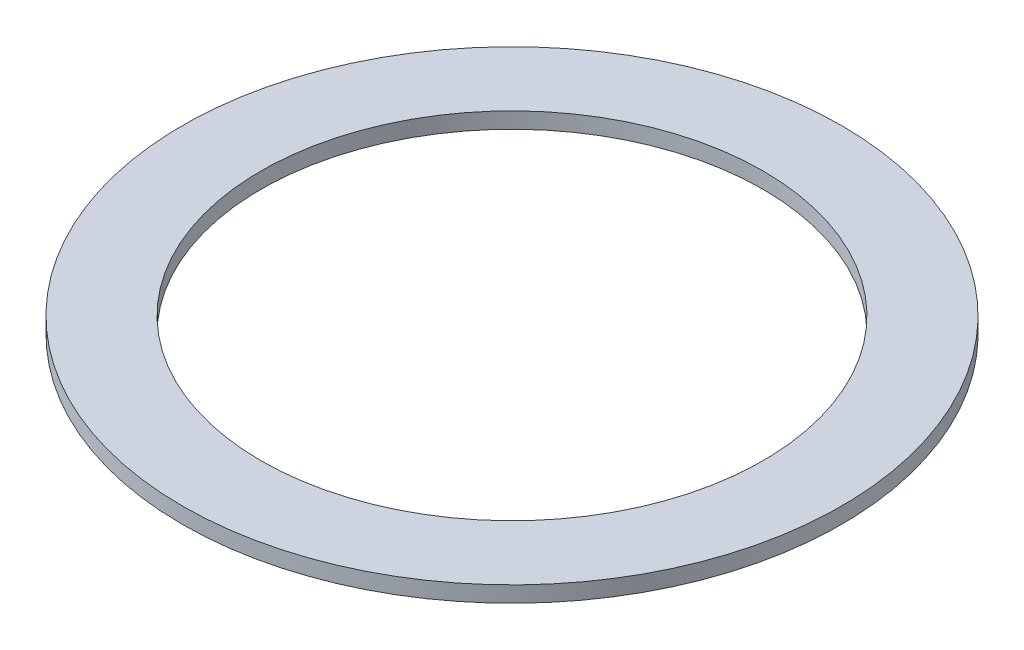
ISO-10303-21;
HEADER;
FILE_DESCRIPTION(('STEP AP214'),'2;1');
FILE_NAME('part.step','',(''),(''),'','','');
FILE_SCHEMA(('AUTOMOTIVE_DESIGN { 1 0 10303 214 1 1 1 1 }'));
ENDSEC;
DATA;
#1=APPLICATION_CONTEXT('core data for automotive mechanical design processes');
#2=APPLICATION_PROTOCOL_DEFINITION('international standard','automotive_design',2000,#1);
#3=PRODUCT_CONTEXT('',#1,'mechanical');
#4=PRODUCT('Part','Part','',(#3));
#5=PRODUCT_RELATED_PRODUCT_CATEGORY('part','',(#4));
#6=PRODUCT_DEFINITION_FORMATION('','',#4);
#7=PRODUCT_DEFINITION_CONTEXT('part definition',#1,'design');
#8=PRODUCT_DEFINITION('design','',#6,#7);
#9=PRODUCT_DEFINITION_SHAPE('','',#8);
#10=(LENGTH_UNIT() NAMED_UNIT(*) SI_UNIT(.MILLI.,.METRE.));
#11=(NAMED_UNIT(*) PLANE_ANGLE_UNIT() SI_UNIT($,.RADIAN.));
#12=(NAMED_UNIT(*) SI_UNIT($,.STERADIAN.) SOLID_ANGLE_UNIT());
#13=UNCERTAINTY_MEASURE_WITH_UNIT(LENGTH_MEASURE(1.E-05),#10,'distance_accuracy_value','');
#14=(GEOMETRIC_REPRESENTATION_CONTEXT(3) GLOBAL_UNCERTAINTY_ASSIGNED_CONTEXT((#13)) GLOBAL_UNIT_ASSIGNED_CONTEXT((#10,
#11,#12)) REPRESENTATION_CONTEXT('',''));
#15=CARTESIAN_POINT('',(0.,0.,0.));
#16=DIRECTION('',(0.,0.,1.));
#17=DIRECTION('',(1.,0.,0.));
#18=AXIS2_PLACEMENT_3D('',#15,#16,#17);
#19=CARTESIAN_POINT('',(0.,0.381,0.));
#20=DIRECTION('',(0.,1.,0.));
#21=DIRECTION('',(0.,0.,1.));
#22=AXIS2_PLACEMENT_3D('',#19,#20,#21);
#23=PLANE('',#22);
#24=CARTESIAN_POINT('',(0.,0.381,0.));
#25=DIRECTION('',(0.,1.,0.));
#26=DIRECTION('',(0.,0.,1.));
#27=AXIS2_PLACEMENT_3D('',#24,#25,#26);
#28=CIRCLE('',#27,7.8867);
#29=CARTESIAN_POINT('',(0.,0.381,7.8867));
#30=VERTEX_POINT('',#29);
#31=EDGE_CURVE('E10',#30,#30,#28,.T.);
#32=ORIENTED_EDGE('',*,*,#31,.T.);
#33=EDGE_LOOP('',(#32));
#34=FACE_BOUND('',#33,.T.);
#35=CARTESIAN_POINT('',(0.,0.381,0.));
#36=DIRECTION('',(0.,1.,0.));
#37=DIRECTION('',(0.,0.,1.));
#38=AXIS2_PLACEMENT_3D('',#35,#36,#37);
#39=CIRCLE('',#38,6.0071);
#40=CARTESIAN_POINT('',(0.,0.381,6.0071));
#41=VERTEX_POINT('',#40);
#42=EDGE_CURVE('E42',#41,#41,#39,.T.);
#43=ORIENTED_EDGE('',*,*,#42,.F.);
#44=EDGE_LOOP('',(#43));
#45=FACE_BOUND('',#44,.T.);
#46=ADVANCED_FACE('F31',(#34,#45),#23,.T.);
#47=CARTESIAN_POINT('',(0.,0.,0.));
#48=DIRECTION('',(0.,1.,0.));
#49=DIRECTION('',(0.,0.,1.));
#50=AXIS2_PLACEMENT_3D('',#47,#48,#49);
#51=PLANE('',#50);
#52=CARTESIAN_POINT('',(0.,0.,0.));
#53=DIRECTION('',(0.,1.,0.));
#54=DIRECTION('',(0.,0.,1.));
#55=AXIS2_PLACEMENT_3D('',#52,#53,#54);
#56=CIRCLE('',#55,7.8867);
#57=CARTESIAN_POINT('',(0.,0.,7.8867));
#58=VERTEX_POINT('',#57);
#59=EDGE_CURVE('E35',#58,#58,#56,.T.);
#60=ORIENTED_EDGE('',*,*,#59,.F.);
#61=EDGE_LOOP('',(#60));
#62=FACE_BOUND('',#61,.T.);
#63=CARTESIAN_POINT('',(0.,0.,0.));
#64=DIRECTION('',(0.,1.,0.));
#65=DIRECTION('',(0.,0.,1.));
#66=AXIS2_PLACEMENT_3D('',#63,#64,#65);
#67=CIRCLE('',#66,6.0071);
#68=CARTESIAN_POINT('',(0.,0.,6.0071));
#69=VERTEX_POINT('',#68);
#70=EDGE_CURVE('E44',#69,#69,#67,.T.);
#71=ORIENTED_EDGE('',*,*,#70,.T.);
#72=EDGE_LOOP('',(#71));
#73=FACE_BOUND('',#72,.T.);
#74=ADVANCED_FACE('F54',(#62,#73),#51,.F.);
#75=CARTESIAN_POINT('',(0.,0.381,0.));
#76=DIRECTION('',(0.,-1.,0.));
#77=DIRECTION('',(0.,0.,-1.));
#78=AXIS2_PLACEMENT_3D('',#75,#76,#77);
#79=CYLINDRICAL_SURFACE('',#78,7.8867);
#80=ORIENTED_EDGE('',*,*,#31,.F.);
#81=EDGE_LOOP('',(#80));
#82=FACE_BOUND('',#81,.T.);
#83=ORIENTED_EDGE('',*,*,#59,.T.);
#84=EDGE_LOOP('',(#83));
#85=FACE_BOUND('',#84,.T.);
#86=ADVANCED_FACE('F33',(#82,#85),#79,.T.);
#87=CARTESIAN_POINT('',(0.,0.381,0.));
#88=DIRECTION('',(0.,-1.,0.));
#89=DIRECTION('',(0.,0.,-1.));
#90=AXIS2_PLACEMENT_3D('',#87,#88,#89);
#91=CYLINDRICAL_SURFACE('',#90,6.0071);
#92=ORIENTED_EDGE('',*,*,#42,.T.);
#93=EDGE_LOOP('',(#92));
#94=FACE_BOUND('',#93,.T.);
#95=ORIENTED_EDGE('',*,*,#70,.F.);
#96=EDGE_LOOP('',(#95));
#97=FACE_BOUND('',#96,.T.);
#98=ADVANCED_FACE('F50',(#94,#97),#91,.F.);
#99=CLOSED_SHELL('',(#46,#74,#86,#98));
#100=MANIFOLD_SOLID_BREP('B2',#99);
#101=ADVANCED_BREP_SHAPE_REPRESENTATION('',(#18,#100),#14);
#102=SHAPE_DEFINITION_REPRESENTATION(#9,#101);
ENDSEC;
END-ISO-10303-21;
